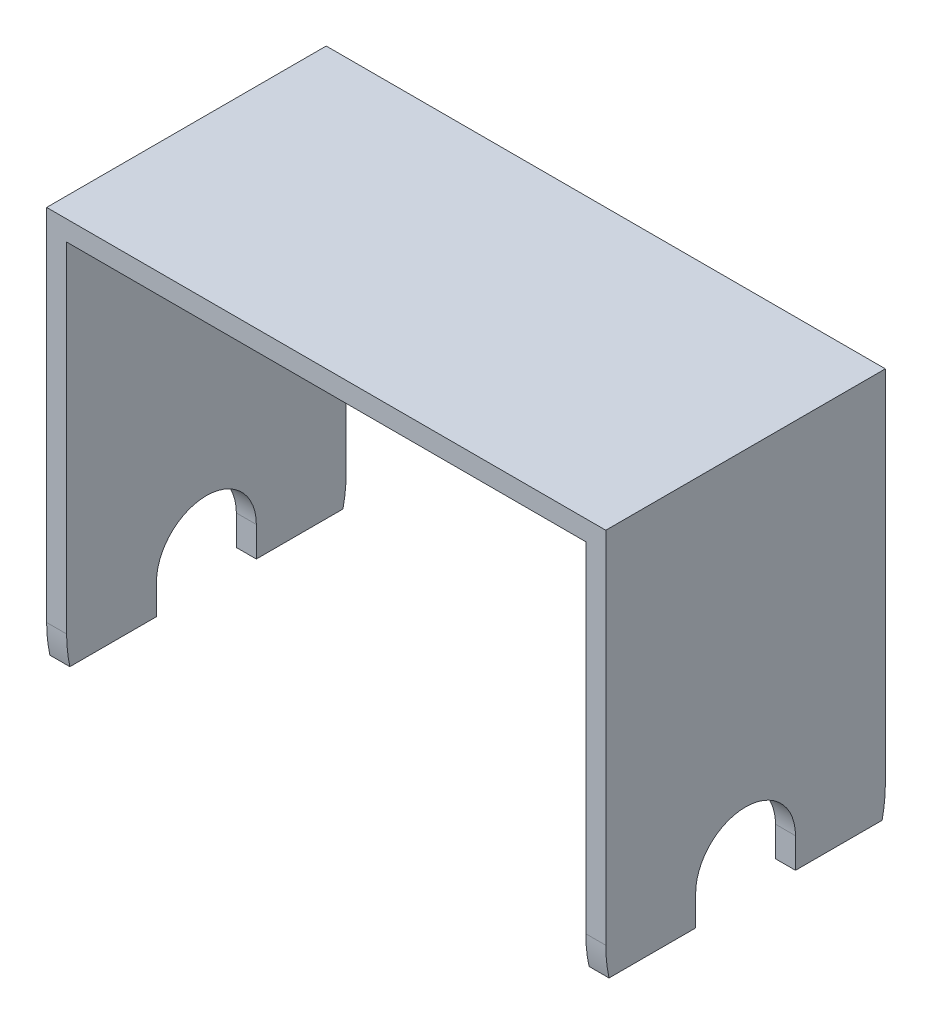
ISO-10303-21;
HEADER;
FILE_DESCRIPTION(('STEP AP214'),'2;1');
FILE_NAME('part.step','',(''),(''),'','','');
FILE_SCHEMA(('AUTOMOTIVE_DESIGN { 1 0 10303 214 1 1 1 1 }'));
ENDSEC;
DATA;
#1=APPLICATION_CONTEXT('core data for automotive mechanical design processes');
#2=APPLICATION_PROTOCOL_DEFINITION('international standard','automotive_design',2000,#1);
#3=PRODUCT_CONTEXT('',#1,'mechanical');
#4=PRODUCT('Part','Part','',(#3));
#5=PRODUCT_RELATED_PRODUCT_CATEGORY('part','',(#4));
#6=PRODUCT_DEFINITION_FORMATION('','',#4);
#7=PRODUCT_DEFINITION_CONTEXT('part definition',#1,'design');
#8=PRODUCT_DEFINITION('design','',#6,#7);
#9=PRODUCT_DEFINITION_SHAPE('','',#8);
#10=(LENGTH_UNIT() NAMED_UNIT(*) SI_UNIT(.MILLI.,.METRE.));
#11=(NAMED_UNIT(*) PLANE_ANGLE_UNIT() SI_UNIT($,.RADIAN.));
#12=(NAMED_UNIT(*) SI_UNIT($,.STERADIAN.) SOLID_ANGLE_UNIT());
#13=UNCERTAINTY_MEASURE_WITH_UNIT(LENGTH_MEASURE(1.E-05),#10,'distance_accuracy_value','');
#14=(GEOMETRIC_REPRESENTATION_CONTEXT(3) GLOBAL_UNCERTAINTY_ASSIGNED_CONTEXT((#13)) GLOBAL_UNIT_ASSIGNED_CONTEXT((#10,
#11,#12)) REPRESENTATION_CONTEXT('',''));
#15=CARTESIAN_POINT('',(0.,0.,0.));
#16=DIRECTION('',(0.,0.,1.));
#17=DIRECTION('',(1.,0.,0.));
#18=AXIS2_PLACEMENT_3D('',#15,#16,#17);
#19=CARTESIAN_POINT('',(28.18661832707,-3.,12.14487907018));
#20=DIRECTION('',(0.,1.,0.));
#21=DIRECTION('',(0.,0.,-1.));
#22=AXIS2_PLACEMENT_3D('',#19,#20,#21);
#23=PLANE('',#22);
#24=DIRECTION('',(0.,0.,-1.));
#25=VECTOR('',#24,1.);
#26=CARTESIAN_POINT('',(27.9999999999966,-3.,9.479130371553));
#27=LINE('',#26,#25);
#28=CARTESIAN_POINT('',(28.,-3.,-5.));
#29=VERTEX_POINT('',#28);
#30=CARTESIAN_POINT('',(28.,-3.,-13.6747943311773));
#31=VERTEX_POINT('',#30);
#32=EDGE_CURVE('E204',#29,#31,#27,.T.);
#33=ORIENTED_EDGE('',*,*,#32,.F.);
#34=DIRECTION('',(-1.,0.,0.));
#35=VECTOR('',#34,1.);
#36=CARTESIAN_POINT('',(28.,-3.,-5.));
#37=LINE('',#36,#35);
#38=CARTESIAN_POINT('',(25.9999999999982,-3.,-5.));
#39=VERTEX_POINT('',#38);
#40=EDGE_CURVE('E455',#29,#39,#37,.T.);
#41=ORIENTED_EDGE('',*,*,#40,.T.);
#42=DIRECTION('',(0.,0.,1.));
#43=VECTOR('',#42,1.);
#44=CARTESIAN_POINT('',(25.9999999999982,-3.,-13.6747943311773));
#45=LINE('',#44,#43);
#46=CARTESIAN_POINT('',(25.9999999999982,-3.,-13.6747943311773));
#47=VERTEX_POINT('',#46);
#48=EDGE_CURVE('E374',#47,#39,#45,.T.);
#49=ORIENTED_EDGE('',*,*,#48,.F.);
#50=DIRECTION('',(1.,0.,0.));
#51=VECTOR('',#50,1.);
#52=CARTESIAN_POINT('',(-27.9999999999964,-3.,-13.6747943311773));
#53=LINE('',#52,#51);
#54=EDGE_CURVE('E263',#31,#47,#53,.F.);
#55=ORIENTED_EDGE('',*,*,#54,.F.);
#56=EDGE_LOOP('',(#33,#41,#49,#55));
#57=FACE_BOUND('',#56,.T.);
#58=ADVANCED_FACE('F41',(#57),#23,.F.);
#59=DIRECTION('',(0.,0.,-1.));
#60=VECTOR('',#59,1.);
#61=CARTESIAN_POINT('',(-27.9999999999966,-3.,-9.479130371553));
#62=LINE('',#61,#60);
#63=CARTESIAN_POINT('',(-28.,-3.,13.6747943311773));
#64=VERTEX_POINT('',#63);
#65=CARTESIAN_POINT('',(-28.,-3.,5.));
#66=VERTEX_POINT('',#65);
#67=EDGE_CURVE('E227',#64,#66,#62,.T.);
#68=ORIENTED_EDGE('',*,*,#67,.T.);
#69=DIRECTION('',(1.,0.,0.));
#70=VECTOR('',#69,1.);
#71=CARTESIAN_POINT('',(-28.,-3.,5.));
#72=LINE('',#71,#70);
#73=CARTESIAN_POINT('',(-25.9999999999975,-3.,5.));
#74=VERTEX_POINT('',#73);
#75=EDGE_CURVE('E359',#66,#74,#72,.T.);
#76=ORIENTED_EDGE('',*,*,#75,.T.);
#77=DIRECTION('',(0.,0.,1.));
#78=VECTOR('',#77,1.);
#79=CARTESIAN_POINT('',(-25.9999999999975,-3.,-13.6747943311773));
#80=LINE('',#79,#78);
#81=CARTESIAN_POINT('',(-25.9999999999975,-3.,13.6747943311773));
#82=VERTEX_POINT('',#81);
#83=EDGE_CURVE('E341',#74,#82,#80,.T.);
#84=ORIENTED_EDGE('',*,*,#83,.T.);
#85=DIRECTION('',(1.,0.,0.));
#86=VECTOR('',#85,1.);
#87=CARTESIAN_POINT('',(26.0000000000036,-3.,13.6747943311773));
#88=LINE('',#87,#86);
#89=EDGE_CURVE('E257',#64,#82,#88,.T.);
#90=ORIENTED_EDGE('',*,*,#89,.F.);
#91=EDGE_LOOP('',(#68,#76,#84,#90));
#92=FACE_BOUND('',#91,.T.);
#93=ADVANCED_FACE('F390',(#92),#23,.F.);
#94=CARTESIAN_POINT('',(26.0000000000036,0.,0.));
#95=DIRECTION('',(1.,0.,0.));
#96=DIRECTION('',(0.,1.,0.));
#97=AXIS2_PLACEMENT_3D('',#94,#95,#96);
#98=CYLINDRICAL_SURFACE('',#97,14.);
#99=CARTESIAN_POINT('',(25.9999999999982,0.,0.));
#100=DIRECTION('',(-1.,0.,0.));
#101=DIRECTION('',(0.,0.,1.));
#102=AXIS2_PLACEMENT_3D('',#99,#100,#101);
#103=CIRCLE('',#102,14.);
#104=CARTESIAN_POINT('',(25.9999999999982,0.,-14.));
#105=VERTEX_POINT('',#104);
#106=EDGE_CURVE('E346',#105,#47,#103,.T.);
#107=ORIENTED_EDGE('',*,*,#106,.F.);
#108=DIRECTION('',(-1.,0.,0.));
#109=VECTOR('',#108,1.);
#110=CARTESIAN_POINT('',(27.,0.,-14.));
#111=LINE('',#110,#109);
#112=CARTESIAN_POINT('',(27.9999999999965,0.,-14.));
#113=VERTEX_POINT('',#112);
#114=EDGE_CURVE('E221',#113,#105,#111,.T.);
#115=ORIENTED_EDGE('',*,*,#114,.F.);
#116=CARTESIAN_POINT('',(27.9999999999963,0.,0.));
#117=DIRECTION('',(1.,0.,0.));
#118=DIRECTION('',(0.,1.,0.));
#119=AXIS2_PLACEMENT_3D('',#116,#117,#118);
#120=CIRCLE('',#119,14.);
#121=EDGE_CURVE('E236',#113,#31,#120,.F.);
#122=ORIENTED_EDGE('',*,*,#121,.T.);
#123=ORIENTED_EDGE('',*,*,#54,.T.);
#124=EDGE_LOOP('',(#107,#115,#122,#123));
#125=FACE_BOUND('',#124,.T.);
#126=ADVANCED_FACE('F383',(#125),#98,.T.);
#127=CARTESIAN_POINT('',(26.0000000000036,0.,0.));
#128=DIRECTION('',(1.,0.,0.));
#129=DIRECTION('',(0.,1.,0.));
#130=AXIS2_PLACEMENT_3D('',#127,#128,#129);
#131=CYLINDRICAL_SURFACE('',#130,14.);
#132=CARTESIAN_POINT('',(25.9999999999982,0.,0.));
#133=DIRECTION('',(-1.,0.,0.));
#134=DIRECTION('',(0.,0.,1.));
#135=AXIS2_PLACEMENT_3D('',#132,#133,#134);
#136=CIRCLE('',#135,14.);
#137=CARTESIAN_POINT('',(25.9999999999982,-3.,13.6747943311773));
#138=VERTEX_POINT('',#137);
#139=CARTESIAN_POINT('',(25.9999999999982,0.,14.));
#140=VERTEX_POINT('',#139);
#141=EDGE_CURVE('E377',#138,#140,#136,.T.);
#142=ORIENTED_EDGE('',*,*,#141,.F.);
#143=CARTESIAN_POINT('',(28.,-3.,13.6747943311773));
#144=VERTEX_POINT('',#143);
#145=EDGE_CURVE('E262',#138,#144,#88,.T.);
#146=ORIENTED_EDGE('',*,*,#145,.T.);
#147=CARTESIAN_POINT('',(27.9999999999963,0.,0.));
#148=DIRECTION('',(1.,0.,0.));
#149=DIRECTION('',(0.,1.,0.));
#150=AXIS2_PLACEMENT_3D('',#147,#148,#149);
#151=CIRCLE('',#150,14.);
#152=CARTESIAN_POINT('',(27.9999999999965,0.,14.));
#153=VERTEX_POINT('',#152);
#154=EDGE_CURVE('E201',#144,#153,#151,.F.);
#155=ORIENTED_EDGE('',*,*,#154,.T.);
#156=DIRECTION('',(-1.,0.,0.));
#157=VECTOR('',#156,1.);
#158=CARTESIAN_POINT('',(27.,0.,14.));
#159=LINE('',#158,#157);
#160=EDGE_CURVE('E211',#153,#140,#159,.T.);
#161=ORIENTED_EDGE('',*,*,#160,.T.);
#162=EDGE_LOOP('',(#142,#146,#155,#161));
#163=FACE_BOUND('',#162,.T.);
#164=ADVANCED_FACE('F381',(#163),#131,.T.);
#165=CARTESIAN_POINT('',(28.18661832707,34.68,-14.));
#166=DIRECTION('',(0.,0.,-1.));
#167=DIRECTION('',(0.,-1.,0.));
#168=AXIS2_PLACEMENT_3D('',#165,#166,#167);
#169=PLANE('',#168);
#170=ORIENTED_EDGE('',*,*,#114,.T.);
#171=DIRECTION('',(0.,-1.,0.));
#172=VECTOR('',#171,1.);
#173=CARTESIAN_POINT('',(25.9999999999982,34.,-14.));
#174=LINE('',#173,#172);
#175=CARTESIAN_POINT('',(25.9999999999982,34.,-14.));
#176=VERTEX_POINT('',#175);
#177=EDGE_CURVE('E348',#176,#105,#174,.T.);
#178=ORIENTED_EDGE('',*,*,#177,.F.);
#179=DIRECTION('',(-1.,0.,0.));
#180=VECTOR('',#179,1.);
#181=CARTESIAN_POINT('',(25.9999999999982,34.,-14.));
#182=LINE('',#181,#180);
#183=CARTESIAN_POINT('',(-25.9999999999975,34.,-14.));
#184=VERTEX_POINT('',#183);
#185=EDGE_CURVE('E244',#176,#184,#182,.T.);
#186=ORIENTED_EDGE('',*,*,#185,.T.);
#187=DIRECTION('',(0.,-1.,0.));
#188=VECTOR('',#187,1.);
#189=CARTESIAN_POINT('',(-25.9999999999975,34.,-14.));
#190=LINE('',#189,#188);
#191=CARTESIAN_POINT('',(-25.9999999999975,0.,-14.));
#192=VERTEX_POINT('',#191);
#193=EDGE_CURVE('E312',#184,#192,#190,.T.);
#194=ORIENTED_EDGE('',*,*,#193,.T.);
#195=CARTESIAN_POINT('',(-27.9999999999965,0.,-14.));
#196=VERTEX_POINT('',#195);
#197=EDGE_CURVE('E226',#192,#196,#111,.T.);
#198=ORIENTED_EDGE('',*,*,#197,.T.);
#199=DIRECTION('',(0.,1.,0.));
#200=VECTOR('',#199,1.);
#201=CARTESIAN_POINT('',(-27.9999999999966,17.,-14.));
#202=LINE('',#201,#200);
#203=CARTESIAN_POINT('',(-28.,36.,-14.));
#204=VERTEX_POINT('',#203);
#205=EDGE_CURVE('E222',#196,#204,#202,.T.);
#206=ORIENTED_EDGE('',*,*,#205,.T.);
#207=DIRECTION('',(-1.,0.,0.));
#208=VECTOR('',#207,1.);
#209=CARTESIAN_POINT('',(25.75,35.9999999999966,-14.));
#210=LINE('',#209,#208);
#211=CARTESIAN_POINT('',(28.,36.,-14.));
#212=VERTEX_POINT('',#211);
#213=EDGE_CURVE('E241',#212,#204,#210,.T.);
#214=ORIENTED_EDGE('',*,*,#213,.F.);
#215=DIRECTION('',(0.,-1.,0.));
#216=VECTOR('',#215,1.);
#217=CARTESIAN_POINT('',(27.9999999999966,17.,-14.));
#218=LINE('',#217,#216);
#219=EDGE_CURVE('E214',#212,#113,#218,.T.);
#220=ORIENTED_EDGE('',*,*,#219,.T.);
#221=EDGE_LOOP('',(#170,#178,#186,#194,#198,#206,#214,#220));
#222=FACE_BOUND('',#221,.T.);
#223=ADVANCED_FACE('F308',(#222),#169,.T.);
#224=CARTESIAN_POINT('',(25.9999999999982,-3.,4.99999999999999));
#225=VERTEX_POINT('',#224);
#226=EDGE_CURVE('E196',#225,#138,#45,.T.);
#227=ORIENTED_EDGE('',*,*,#226,.F.);
#228=DIRECTION('',(-1.,0.,0.));
#229=VECTOR('',#228,1.);
#230=CARTESIAN_POINT('',(28.,-3.,5.));
#231=LINE('',#230,#229);
#232=CARTESIAN_POINT('',(28.,-3.,5.));
#233=VERTEX_POINT('',#232);
#234=EDGE_CURVE('E57',#233,#225,#231,.T.);
#235=ORIENTED_EDGE('',*,*,#234,.F.);
#236=EDGE_CURVE('E194',#144,#233,#27,.T.);
#237=ORIENTED_EDGE('',*,*,#236,.F.);
#238=ORIENTED_EDGE('',*,*,#145,.F.);
#239=EDGE_LOOP('',(#227,#235,#237,#238));
#240=FACE_BOUND('',#239,.T.);
#241=ADVANCED_FACE('F192',(#240),#23,.F.);
#242=CARTESIAN_POINT('',(28.18661832707,34.68,14.));
#243=DIRECTION('',(0.,0.,-1.));
#244=DIRECTION('',(0.,-1.,0.));
#245=AXIS2_PLACEMENT_3D('',#242,#243,#244);
#246=PLANE('',#245);
#247=DIRECTION('',(0.,1.,0.));
#248=VECTOR('',#247,1.);
#249=CARTESIAN_POINT('',(25.9999999999982,0.,14.));
#250=LINE('',#249,#248);
#251=CARTESIAN_POINT('',(25.9999999999982,34.,14.));
#252=VERTEX_POINT('',#251);
#253=EDGE_CURVE('E355',#140,#252,#250,.T.);
#254=ORIENTED_EDGE('',*,*,#253,.F.);
#255=ORIENTED_EDGE('',*,*,#160,.F.);
#256=DIRECTION('',(0.,-1.,0.));
#257=VECTOR('',#256,1.);
#258=CARTESIAN_POINT('',(27.9999999999966,17.,14.));
#259=LINE('',#258,#257);
#260=CARTESIAN_POINT('',(28.,36.,14.));
#261=VERTEX_POINT('',#260);
#262=EDGE_CURVE('E217',#261,#153,#259,.T.);
#263=ORIENTED_EDGE('',*,*,#262,.F.);
#264=DIRECTION('',(-1.,0.,0.));
#265=VECTOR('',#264,1.);
#266=CARTESIAN_POINT('',(25.75,35.9999999999966,14.));
#267=LINE('',#266,#265);
#268=CARTESIAN_POINT('',(-28.,36.,14.));
#269=VERTEX_POINT('',#268);
#270=EDGE_CURVE('E237',#261,#269,#267,.T.);
#271=ORIENTED_EDGE('',*,*,#270,.T.);
#272=DIRECTION('',(0.,1.,0.));
#273=VECTOR('',#272,1.);
#274=CARTESIAN_POINT('',(-27.9999999999966,17.,14.));
#275=LINE('',#274,#273);
#276=CARTESIAN_POINT('',(-27.9999999999965,0.,14.));
#277=VERTEX_POINT('',#276);
#278=EDGE_CURVE('E232',#277,#269,#275,.T.);
#279=ORIENTED_EDGE('',*,*,#278,.F.);
#280=CARTESIAN_POINT('',(-25.9999999999975,0.,14.));
#281=VERTEX_POINT('',#280);
#282=EDGE_CURVE('E203',#281,#277,#159,.T.);
#283=ORIENTED_EDGE('',*,*,#282,.F.);
#284=DIRECTION('',(0.,1.,0.));
#285=VECTOR('',#284,1.);
#286=CARTESIAN_POINT('',(-25.9999999999975,0.,14.));
#287=LINE('',#286,#285);
#288=CARTESIAN_POINT('',(-25.9999999999975,34.,14.));
#289=VERTEX_POINT('',#288);
#290=EDGE_CURVE('E328',#281,#289,#287,.T.);
#291=ORIENTED_EDGE('',*,*,#290,.T.);
#292=DIRECTION('',(-1.,0.,0.));
#293=VECTOR('',#292,1.);
#294=CARTESIAN_POINT('',(25.9999999999982,34.,14.));
#295=LINE('',#294,#293);
#296=EDGE_CURVE('E293',#252,#289,#295,.T.);
#297=ORIENTED_EDGE('',*,*,#296,.F.);
#298=EDGE_LOOP('',(#254,#255,#263,#271,#279,#283,#291,#297));
#299=FACE_BOUND('',#298,.T.);
#300=ADVANCED_FACE('F280',(#299),#246,.F.);
#301=CARTESIAN_POINT('',(-28.,-3.74,-14.56));
#302=DIRECTION('',(1.,0.,0.));
#303=DIRECTION('',(0.,1.,0.));
#304=AXIS2_PLACEMENT_3D('',#301,#302,#303);
#305=PLANE('',#304);
#306=CARTESIAN_POINT('',(-28.,0.,0.));
#307=DIRECTION('',(1.,0.,0.));
#308=DIRECTION('',(0.,0.,-1.));
#309=AXIS2_PLACEMENT_3D('',#306,#307,#308);
#310=CIRCLE('',#309,5.);
#311=CARTESIAN_POINT('',(-28.,0.,-5.));
#312=VERTEX_POINT('',#311);
#313=CARTESIAN_POINT('',(-28.,0.,5.));
#314=VERTEX_POINT('',#313);
#315=EDGE_CURVE('E477',#312,#314,#310,.T.);
#316=ORIENTED_EDGE('',*,*,#315,.T.);
#317=DIRECTION('',(0.,-1.,0.));
#318=VECTOR('',#317,1.);
#319=CARTESIAN_POINT('',(-28.,0.,5.));
#320=LINE('',#319,#318);
#321=EDGE_CURVE('E372',#314,#66,#320,.T.);
#322=ORIENTED_EDGE('',*,*,#321,.T.);
#323=ORIENTED_EDGE('',*,*,#67,.F.);
#324=CARTESIAN_POINT('',(-27.9999999999964,0.,0.));
#325=DIRECTION('',(1.,0.,0.));
#326=DIRECTION('',(0.,0.,-1.));
#327=AXIS2_PLACEMENT_3D('',#324,#325,#326);
#328=CIRCLE('',#327,14.);
#329=EDGE_CURVE('E250',#277,#64,#328,.T.);
#330=ORIENTED_EDGE('',*,*,#329,.F.);
#331=ORIENTED_EDGE('',*,*,#278,.T.);
#332=DIRECTION('',(0.,0.,-1.));
#333=VECTOR('',#332,1.);
#334=CARTESIAN_POINT('',(-28.,36.,-14.56));
#335=LINE('',#334,#333);
#336=EDGE_CURVE('E12',#204,#269,#335,.F.);
#337=ORIENTED_EDGE('',*,*,#336,.F.);
#338=ORIENTED_EDGE('',*,*,#205,.F.);
#339=CARTESIAN_POINT('',(-27.9999999999964,0.,0.));
#340=DIRECTION('',(1.,0.,0.));
#341=DIRECTION('',(0.,0.,-1.));
#342=AXIS2_PLACEMENT_3D('',#339,#340,#341);
#343=CIRCLE('',#342,14.);
#344=CARTESIAN_POINT('',(-28.,-3.,-13.6747943311773));
#345=VERTEX_POINT('',#344);
#346=EDGE_CURVE('E240',#345,#196,#343,.T.);
#347=ORIENTED_EDGE('',*,*,#346,.F.);
#348=CARTESIAN_POINT('',(-28.,-3.,-5.));
#349=VERTEX_POINT('',#348);
#350=EDGE_CURVE('E231',#349,#345,#62,.T.);
#351=ORIENTED_EDGE('',*,*,#350,.F.);
#352=DIRECTION('',(0.,1.,0.));
#353=VECTOR('',#352,1.);
#354=CARTESIAN_POINT('',(-28.,-3.,-5.));
#355=LINE('',#354,#353);
#356=EDGE_CURVE('E474',#349,#312,#355,.T.);
#357=ORIENTED_EDGE('',*,*,#356,.T.);
#358=EDGE_LOOP('',(#316,#322,#323,#330,#331,#337,#338,#347,#351,#357));
#359=FACE_BOUND('',#358,.T.);
#360=ADVANCED_FACE('F322',(#359),#305,.F.);
#361=ORIENTED_EDGE('',*,*,#197,.F.);
#362=CARTESIAN_POINT('',(-25.9999999999975,0.,0.));
#363=DIRECTION('',(-1.,0.,0.));
#364=DIRECTION('',(0.,0.,1.));
#365=AXIS2_PLACEMENT_3D('',#362,#363,#364);
#366=CIRCLE('',#365,14.);
#367=CARTESIAN_POINT('',(-25.9999999999975,-3.,-13.6747943311773));
#368=VERTEX_POINT('',#367);
#369=EDGE_CURVE('E358',#192,#368,#366,.T.);
#370=ORIENTED_EDGE('',*,*,#369,.T.);
#371=EDGE_CURVE('E261',#368,#345,#53,.F.);
#372=ORIENTED_EDGE('',*,*,#371,.T.);
#373=ORIENTED_EDGE('',*,*,#346,.T.);
#374=EDGE_LOOP('',(#361,#370,#372,#373));
#375=FACE_BOUND('',#374,.T.);
#376=ADVANCED_FACE('F317',(#375),#98,.T.);
#377=ORIENTED_EDGE('',*,*,#89,.T.);
#378=CARTESIAN_POINT('',(-25.9999999999975,0.,0.));
#379=DIRECTION('',(-1.,0.,0.));
#380=DIRECTION('',(0.,0.,1.));
#381=AXIS2_PLACEMENT_3D('',#378,#379,#380);
#382=CIRCLE('',#381,14.);
#383=EDGE_CURVE('E333',#82,#281,#382,.T.);
#384=ORIENTED_EDGE('',*,*,#383,.T.);
#385=ORIENTED_EDGE('',*,*,#282,.T.);
#386=ORIENTED_EDGE('',*,*,#329,.T.);
#387=EDGE_LOOP('',(#377,#384,#385,#386));
#388=FACE_BOUND('',#387,.T.);
#389=ADVANCED_FACE('F331',(#388),#131,.T.);
#390=CARTESIAN_POINT('',(28.,34.74,-14.56));
#391=DIRECTION('',(-1.,0.,0.));
#392=DIRECTION('',(0.,-1.,0.));
#393=AXIS2_PLACEMENT_3D('',#390,#391,#392);
#394=PLANE('',#393);
#395=CARTESIAN_POINT('',(28.,0.,0.));
#396=DIRECTION('',(-1.,0.,0.));
#397=DIRECTION('',(0.,0.,1.));
#398=AXIS2_PLACEMENT_3D('',#395,#396,#397);
#399=CIRCLE('',#398,5.);
#400=CARTESIAN_POINT('',(28.,0.,5.));
#401=VERTEX_POINT('',#400);
#402=CARTESIAN_POINT('',(28.,0.,-5.));
#403=VERTEX_POINT('',#402);
#404=EDGE_CURVE('E186',#401,#403,#399,.T.);
#405=ORIENTED_EDGE('',*,*,#404,.T.);
#406=DIRECTION('',(0.,-1.,0.));
#407=VECTOR('',#406,1.);
#408=CARTESIAN_POINT('',(28.,0.,-5.));
#409=LINE('',#408,#407);
#410=EDGE_CURVE('E197',#403,#29,#409,.T.);
#411=ORIENTED_EDGE('',*,*,#410,.T.);
#412=ORIENTED_EDGE('',*,*,#32,.T.);
#413=ORIENTED_EDGE('',*,*,#121,.F.);
#414=ORIENTED_EDGE('',*,*,#219,.F.);
#415=DIRECTION('',(0.,0.,-1.));
#416=VECTOR('',#415,1.);
#417=CARTESIAN_POINT('',(28.,36.,-15.08));
#418=LINE('',#417,#416);
#419=EDGE_CURVE('E50',#212,#261,#418,.F.);
#420=ORIENTED_EDGE('',*,*,#419,.T.);
#421=ORIENTED_EDGE('',*,*,#262,.T.);
#422=ORIENTED_EDGE('',*,*,#154,.F.);
#423=ORIENTED_EDGE('',*,*,#236,.T.);
#424=DIRECTION('',(0.,1.,0.));
#425=VECTOR('',#424,1.);
#426=CARTESIAN_POINT('',(28.,-3.,5.));
#427=LINE('',#426,#425);
#428=EDGE_CURVE('E179',#233,#401,#427,.T.);
#429=ORIENTED_EDGE('',*,*,#428,.T.);
#430=EDGE_LOOP('',(#405,#411,#412,#413,#414,#420,#421,#422,#423,#429));
#431=FACE_BOUND('',#430,.T.);
#432=ADVANCED_FACE('F199',(#431),#394,.F.);
#433=CARTESIAN_POINT('',(-25.9999999999975,-3.,-5.));
#434=VERTEX_POINT('',#433);
#435=EDGE_CURVE('E336',#368,#434,#80,.T.);
#436=ORIENTED_EDGE('',*,*,#435,.T.);
#437=DIRECTION('',(1.,0.,0.));
#438=VECTOR('',#437,1.);
#439=CARTESIAN_POINT('',(-28.,-3.,-5.));
#440=LINE('',#439,#438);
#441=EDGE_CURVE('E65',#349,#434,#440,.T.);
#442=ORIENTED_EDGE('',*,*,#441,.F.);
#443=ORIENTED_EDGE('',*,*,#350,.T.);
#444=ORIENTED_EDGE('',*,*,#371,.F.);
#445=EDGE_LOOP('',(#436,#442,#443,#444));
#446=FACE_BOUND('',#445,.T.);
#447=ADVANCED_FACE('F398',(#446),#23,.F.);
#448=CARTESIAN_POINT('',(-27.04,36.,-15.08));
#449=DIRECTION('',(0.,-1.,0.));
#450=DIRECTION('',(1.,0.,0.));
#451=AXIS2_PLACEMENT_3D('',#448,#449,#450);
#452=PLANE('',#451);
#453=ORIENTED_EDGE('',*,*,#213,.T.);
#454=ORIENTED_EDGE('',*,*,#336,.T.);
#455=ORIENTED_EDGE('',*,*,#270,.F.);
#456=ORIENTED_EDGE('',*,*,#419,.F.);
#457=EDGE_LOOP('',(#453,#454,#455,#456));
#458=FACE_BOUND('',#457,.T.);
#459=ADVANCED_FACE('F43',(#458),#452,.F.);
#460=CARTESIAN_POINT('',(25.9999999999982,34.,14.));
#461=DIRECTION('',(0.,1.,0.));
#462=DIRECTION('',(0.,0.,1.));
#463=AXIS2_PLACEMENT_3D('',#460,#461,#462);
#464=PLANE('',#463);
#465=DIRECTION('',(0.,0.,-1.));
#466=VECTOR('',#465,1.);
#467=CARTESIAN_POINT('',(-25.9999999999975,34.,14.));
#468=LINE('',#467,#466);
#469=EDGE_CURVE('E338',#289,#184,#468,.T.);
#470=ORIENTED_EDGE('',*,*,#469,.T.);
#471=ORIENTED_EDGE('',*,*,#185,.F.);
#472=DIRECTION('',(0.,0.,-1.));
#473=VECTOR('',#472,1.);
#474=CARTESIAN_POINT('',(25.9999999999982,34.,14.));
#475=LINE('',#474,#473);
#476=EDGE_CURVE('E350',#252,#176,#475,.T.);
#477=ORIENTED_EDGE('',*,*,#476,.F.);
#478=ORIENTED_EDGE('',*,*,#296,.T.);
#479=EDGE_LOOP('',(#470,#471,#477,#478));
#480=FACE_BOUND('',#479,.T.);
#481=ADVANCED_FACE('F409',(#480),#464,.F.);
#482=CARTESIAN_POINT('',(25.9999999999982,0.,0.));
#483=DIRECTION('',(-1.,0.,0.));
#484=DIRECTION('',(0.,0.,1.));
#485=AXIS2_PLACEMENT_3D('',#482,#483,#484);
#486=PLANE('',#485);
#487=DIRECTION('',(0.,-1.,0.));
#488=VECTOR('',#487,1.);
#489=CARTESIAN_POINT('',(25.9999999999982,0.,-5.));
#490=LINE('',#489,#488);
#491=CARTESIAN_POINT('',(25.9999999999982,0.,-5.));
#492=VERTEX_POINT('',#491);
#493=EDGE_CURVE('E187',#492,#39,#490,.T.);
#494=ORIENTED_EDGE('',*,*,#493,.F.);
#495=CARTESIAN_POINT('',(25.9999999999982,0.,0.));
#496=DIRECTION('',(-1.,0.,0.));
#497=DIRECTION('',(0.,0.,1.));
#498=AXIS2_PLACEMENT_3D('',#495,#496,#497);
#499=CIRCLE('',#498,5.);
#500=CARTESIAN_POINT('',(25.9999999999982,0.,5.));
#501=VERTEX_POINT('',#500);
#502=EDGE_CURVE('E460',#501,#492,#499,.T.);
#503=ORIENTED_EDGE('',*,*,#502,.F.);
#504=DIRECTION('',(0.,1.,0.));
#505=VECTOR('',#504,1.);
#506=CARTESIAN_POINT('',(25.9999999999982,-3.,5.));
#507=LINE('',#506,#505);
#508=EDGE_CURVE('E469',#225,#501,#507,.T.);
#509=ORIENTED_EDGE('',*,*,#508,.F.);
#510=ORIENTED_EDGE('',*,*,#226,.T.);
#511=ORIENTED_EDGE('',*,*,#141,.T.);
#512=ORIENTED_EDGE('',*,*,#253,.T.);
#513=ORIENTED_EDGE('',*,*,#476,.T.);
#514=ORIENTED_EDGE('',*,*,#177,.T.);
#515=ORIENTED_EDGE('',*,*,#106,.T.);
#516=ORIENTED_EDGE('',*,*,#48,.T.);
#517=EDGE_LOOP('',(#494,#503,#509,#510,#511,#512,#513,#514,#515,#516));
#518=FACE_BOUND('',#517,.T.);
#519=ADVANCED_FACE('F380',(#518),#486,.T.);
#520=CARTESIAN_POINT('',(-25.9999999999975,0.,0.));
#521=DIRECTION('',(-1.,0.,0.));
#522=DIRECTION('',(0.,0.,1.));
#523=AXIS2_PLACEMENT_3D('',#520,#521,#522);
#524=PLANE('',#523);
#525=ORIENTED_EDGE('',*,*,#83,.F.);
#526=DIRECTION('',(0.,-1.,0.));
#527=VECTOR('',#526,1.);
#528=CARTESIAN_POINT('',(-25.9999999999975,0.,5.));
#529=LINE('',#528,#527);
#530=CARTESIAN_POINT('',(-25.9999999999975,0.,5.));
#531=VERTEX_POINT('',#530);
#532=EDGE_CURVE('E367',#531,#74,#529,.T.);
#533=ORIENTED_EDGE('',*,*,#532,.F.);
#534=CARTESIAN_POINT('',(-25.9999999999975,0.,0.));
#535=DIRECTION('',(1.,0.,0.));
#536=DIRECTION('',(0.,0.,-1.));
#537=AXIS2_PLACEMENT_3D('',#534,#535,#536);
#538=CIRCLE('',#537,5.);
#539=CARTESIAN_POINT('',(-25.9999999999975,0.,-5.));
#540=VERTEX_POINT('',#539);
#541=EDGE_CURVE('E481',#540,#531,#538,.T.);
#542=ORIENTED_EDGE('',*,*,#541,.F.);
#543=DIRECTION('',(0.,1.,0.));
#544=VECTOR('',#543,1.);
#545=CARTESIAN_POINT('',(-25.9999999999975,-3.,-5.));
#546=LINE('',#545,#544);
#547=EDGE_CURVE('E464',#434,#540,#546,.T.);
#548=ORIENTED_EDGE('',*,*,#547,.F.);
#549=ORIENTED_EDGE('',*,*,#435,.F.);
#550=ORIENTED_EDGE('',*,*,#369,.F.);
#551=ORIENTED_EDGE('',*,*,#193,.F.);
#552=ORIENTED_EDGE('',*,*,#469,.F.);
#553=ORIENTED_EDGE('',*,*,#290,.F.);
#554=ORIENTED_EDGE('',*,*,#383,.F.);
#555=EDGE_LOOP('',(#525,#533,#542,#548,#549,#550,#551,#552,#553,#554));
#556=FACE_BOUND('',#555,.T.);
#557=ADVANCED_FACE('F426',(#556),#524,.F.);
#558=CARTESIAN_POINT('',(-28.,0.,5.));
#559=DIRECTION('',(0.,0.,1.));
#560=DIRECTION('',(1.,0.,0.));
#561=AXIS2_PLACEMENT_3D('',#558,#559,#560);
#562=PLANE('',#561);
#563=ORIENTED_EDGE('',*,*,#532,.T.);
#564=ORIENTED_EDGE('',*,*,#75,.F.);
#565=ORIENTED_EDGE('',*,*,#321,.F.);
#566=DIRECTION('',(1.,0.,0.));
#567=VECTOR('',#566,1.);
#568=CARTESIAN_POINT('',(-28.,0.,5.));
#569=LINE('',#568,#567);
#570=EDGE_CURVE('E361',#314,#531,#569,.T.);
#571=ORIENTED_EDGE('',*,*,#570,.T.);
#572=EDGE_LOOP('',(#563,#564,#565,#571));
#573=FACE_BOUND('',#572,.T.);
#574=ADVANCED_FACE('F430',(#573),#562,.F.);
#575=CARTESIAN_POINT('',(-28.,0.,0.));
#576=DIRECTION('',(1.,0.,0.));
#577=DIRECTION('',(0.,0.,-1.));
#578=AXIS2_PLACEMENT_3D('',#575,#576,#577);
#579=CYLINDRICAL_SURFACE('',#578,5.);
#580=ORIENTED_EDGE('',*,*,#541,.T.);
#581=ORIENTED_EDGE('',*,*,#570,.F.);
#582=ORIENTED_EDGE('',*,*,#315,.F.);
#583=DIRECTION('',(1.,0.,0.));
#584=VECTOR('',#583,1.);
#585=CARTESIAN_POINT('',(-28.,0.,-5.));
#586=LINE('',#585,#584);
#587=EDGE_CURVE('E364',#312,#540,#586,.T.);
#588=ORIENTED_EDGE('',*,*,#587,.T.);
#589=EDGE_LOOP('',(#580,#581,#582,#588));
#590=FACE_BOUND('',#589,.T.);
#591=ADVANCED_FACE('F436',(#590),#579,.F.);
#592=CARTESIAN_POINT('',(-28.,-3.,-5.));
#593=DIRECTION('',(0.,0.,-1.));
#594=DIRECTION('',(-1.,0.,0.));
#595=AXIS2_PLACEMENT_3D('',#592,#593,#594);
#596=PLANE('',#595);
#597=ORIENTED_EDGE('',*,*,#547,.T.);
#598=ORIENTED_EDGE('',*,*,#587,.F.);
#599=ORIENTED_EDGE('',*,*,#356,.F.);
#600=ORIENTED_EDGE('',*,*,#441,.T.);
#601=EDGE_LOOP('',(#597,#598,#599,#600));
#602=FACE_BOUND('',#601,.T.);
#603=ADVANCED_FACE('F432',(#602),#596,.F.);
#604=CARTESIAN_POINT('',(28.,0.,-5.));
#605=DIRECTION('',(0.,0.,-1.));
#606=DIRECTION('',(-1.,0.,0.));
#607=AXIS2_PLACEMENT_3D('',#604,#605,#606);
#608=PLANE('',#607);
#609=ORIENTED_EDGE('',*,*,#493,.T.);
#610=ORIENTED_EDGE('',*,*,#40,.F.);
#611=ORIENTED_EDGE('',*,*,#410,.F.);
#612=DIRECTION('',(-1.,0.,0.));
#613=VECTOR('',#612,1.);
#614=CARTESIAN_POINT('',(28.,0.,-5.));
#615=LINE('',#614,#613);
#616=EDGE_CURVE('E457',#403,#492,#615,.T.);
#617=ORIENTED_EDGE('',*,*,#616,.T.);
#618=EDGE_LOOP('',(#609,#610,#611,#617));
#619=FACE_BOUND('',#618,.T.);
#620=ADVANCED_FACE('F435',(#619),#608,.F.);
#621=CARTESIAN_POINT('',(28.,0.,0.));
#622=DIRECTION('',(-1.,0.,0.));
#623=DIRECTION('',(0.,0.,1.));
#624=AXIS2_PLACEMENT_3D('',#621,#622,#623);
#625=CYLINDRICAL_SURFACE('',#624,5.);
#626=ORIENTED_EDGE('',*,*,#502,.T.);
#627=ORIENTED_EDGE('',*,*,#616,.F.);
#628=ORIENTED_EDGE('',*,*,#404,.F.);
#629=DIRECTION('',(-1.,0.,0.));
#630=VECTOR('',#629,1.);
#631=CARTESIAN_POINT('',(28.,0.,5.));
#632=LINE('',#631,#630);
#633=EDGE_CURVE('E181',#401,#501,#632,.T.);
#634=ORIENTED_EDGE('',*,*,#633,.T.);
#635=EDGE_LOOP('',(#626,#627,#628,#634));
#636=FACE_BOUND('',#635,.T.);
#637=ADVANCED_FACE('F445',(#636),#625,.F.);
#638=CARTESIAN_POINT('',(28.,-3.,5.));
#639=DIRECTION('',(0.,0.,1.));
#640=DIRECTION('',(1.,0.,0.));
#641=AXIS2_PLACEMENT_3D('',#638,#639,#640);
#642=PLANE('',#641);
#643=ORIENTED_EDGE('',*,*,#508,.T.);
#644=ORIENTED_EDGE('',*,*,#633,.F.);
#645=ORIENTED_EDGE('',*,*,#428,.F.);
#646=ORIENTED_EDGE('',*,*,#234,.T.);
#647=EDGE_LOOP('',(#643,#644,#645,#646));
#648=FACE_BOUND('',#647,.T.);
#649=ADVANCED_FACE('F180',(#648),#642,.F.);
#650=CLOSED_SHELL('',(#58,#93,#126,#164,#223,#241,#300,#360,#376,#389,#432,#447,#459,#481,#519,
#557,#574,#591,#603,#620,#637,#649));
#651=MANIFOLD_SOLID_BREP('B2',#650);
#652=ADVANCED_BREP_SHAPE_REPRESENTATION('',(#18,#651),#14);
#653=SHAPE_DEFINITION_REPRESENTATION(#9,#652);
ENDSEC;
END-ISO-10303-21;
